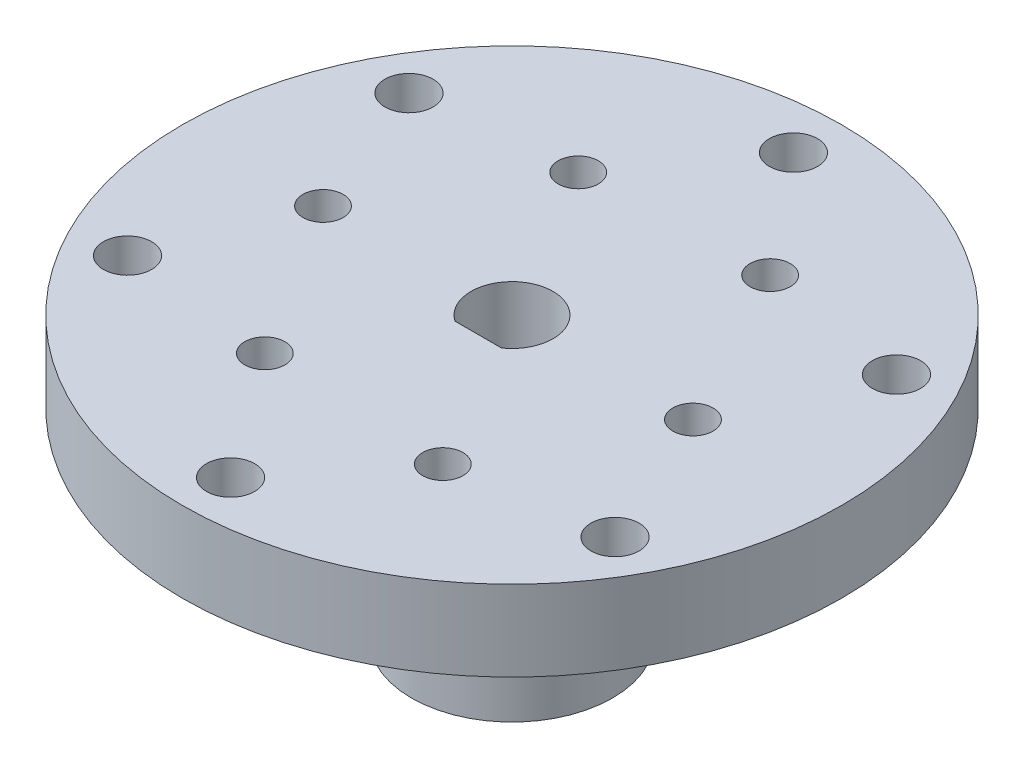
ISO-10303-21;
HEADER;
FILE_DESCRIPTION(('STEP AP214'),'2;1');
FILE_NAME('part.step','',(''),(''),'','','');
FILE_SCHEMA(('AUTOMOTIVE_DESIGN { 1 0 10303 214 1 1 1 1 }'));
ENDSEC;
DATA;
#1=APPLICATION_CONTEXT('core data for automotive mechanical design processes');
#2=APPLICATION_PROTOCOL_DEFINITION('international standard','automotive_design',2000,#1);
#3=PRODUCT_CONTEXT('',#1,'mechanical');
#4=PRODUCT('Part','Part','',(#3));
#5=PRODUCT_RELATED_PRODUCT_CATEGORY('part','',(#4));
#6=PRODUCT_DEFINITION_FORMATION('','',#4);
#7=PRODUCT_DEFINITION_CONTEXT('part definition',#1,'design');
#8=PRODUCT_DEFINITION('design','',#6,#7);
#9=PRODUCT_DEFINITION_SHAPE('','',#8);
#10=(LENGTH_UNIT() NAMED_UNIT(*) SI_UNIT(.MILLI.,.METRE.));
#11=(NAMED_UNIT(*) PLANE_ANGLE_UNIT() SI_UNIT($,.RADIAN.));
#12=(NAMED_UNIT(*) SI_UNIT($,.STERADIAN.) SOLID_ANGLE_UNIT());
#13=UNCERTAINTY_MEASURE_WITH_UNIT(LENGTH_MEASURE(1.E-05),#10,'distance_accuracy_value','');
#14=(GEOMETRIC_REPRESENTATION_CONTEXT(3) GLOBAL_UNCERTAINTY_ASSIGNED_CONTEXT((#13)) GLOBAL_UNIT_ASSIGNED_CONTEXT((#10,
#11,#12)) REPRESENTATION_CONTEXT('',''));
#15=CARTESIAN_POINT('',(0.,0.,0.));
#16=DIRECTION('',(0.,0.,1.));
#17=DIRECTION('',(1.,0.,0.));
#18=AXIS2_PLACEMENT_3D('',#15,#16,#17);
#19=CARTESIAN_POINT('',(0.,35.,0.));
#20=DIRECTION('',(0.,-1.,0.));
#21=DIRECTION('',(0.,0.,-1.));
#22=AXIS2_PLACEMENT_3D('',#19,#20,#21);
#23=CYLINDRICAL_SURFACE('',#22,41.);
#24=CARTESIAN_POINT('',(0.,35.,0.));
#25=DIRECTION('',(0.,1.,0.));
#26=DIRECTION('',(0.,0.,1.));
#27=AXIS2_PLACEMENT_3D('',#24,#25,#26);
#28=CIRCLE('',#27,41.);
#29=CARTESIAN_POINT('',(0.,35.,41.));
#30=VERTEX_POINT('',#29);
#31=EDGE_CURVE('E69',#30,#30,#28,.T.);
#32=ORIENTED_EDGE('',*,*,#31,.F.);
#33=EDGE_LOOP('',(#32));
#34=FACE_BOUND('',#33,.T.);
#35=CARTESIAN_POINT('',(0.,25.,0.));
#36=DIRECTION('',(0.,-1.,0.));
#37=DIRECTION('',(0.,0.,-1.));
#38=AXIS2_PLACEMENT_3D('',#35,#36,#37);
#39=CIRCLE('',#38,41.);
#40=CARTESIAN_POINT('',(0.,25.,-41.));
#41=VERTEX_POINT('',#40);
#42=EDGE_CURVE('E120',#41,#41,#39,.T.);
#43=ORIENTED_EDGE('',*,*,#42,.F.);
#44=EDGE_LOOP('',(#43));
#45=FACE_BOUND('',#44,.T.);
#46=ADVANCED_FACE('F36',(#34,#45),#23,.T.);
#47=CARTESIAN_POINT('',(30.3108891324554,0.,-17.5));
#48=DIRECTION('',(0.,1.,0.));
#49=DIRECTION('',(0.,0.,1.));
#50=AXIS2_PLACEMENT_3D('',#47,#48,#49);
#51=CYLINDRICAL_SURFACE('',#50,3.00000000000009);
#52=CARTESIAN_POINT('',(30.3108891324554,35.,-17.5));
#53=DIRECTION('',(0.,1.,0.));
#54=DIRECTION('',(0.,0.,1.));
#55=AXIS2_PLACEMENT_3D('',#52,#53,#54);
#56=CIRCLE('',#55,3.00000000000009);
#57=CARTESIAN_POINT('',(30.3108891324554,35.,-14.4999999999999));
#58=VERTEX_POINT('',#57);
#59=EDGE_CURVE('E94',#58,#58,#56,.T.);
#60=ORIENTED_EDGE('',*,*,#59,.T.);
#61=EDGE_LOOP('',(#60));
#62=FACE_BOUND('',#61,.T.);
#63=CARTESIAN_POINT('',(30.3108891324554,25.,-17.5));
#64=DIRECTION('',(0.,-1.,0.));
#65=DIRECTION('',(0.,0.,-1.));
#66=AXIS2_PLACEMENT_3D('',#63,#64,#65);
#67=CIRCLE('',#66,3.00000000000009);
#68=CARTESIAN_POINT('',(30.3108891324554,25.,-20.5000000000001));
#69=VERTEX_POINT('',#68);
#70=EDGE_CURVE('E115',#69,#69,#67,.F.);
#71=ORIENTED_EDGE('',*,*,#70,.F.);
#72=EDGE_LOOP('',(#71));
#73=FACE_BOUND('',#72,.T.);
#74=ADVANCED_FACE('F199',(#62,#73),#51,.F.);
#75=CARTESIAN_POINT('',(30.3108891324554,0.,17.5));
#76=DIRECTION('',(0.,1.,0.));
#77=DIRECTION('',(0.,0.,1.));
#78=AXIS2_PLACEMENT_3D('',#75,#76,#77);
#79=CYLINDRICAL_SURFACE('',#78,3.00000000000017);
#80=CARTESIAN_POINT('',(30.3108891324554,35.,17.5));
#81=DIRECTION('',(0.,1.,0.));
#82=DIRECTION('',(0.,0.,1.));
#83=AXIS2_PLACEMENT_3D('',#80,#81,#82);
#84=CIRCLE('',#83,3.00000000000017);
#85=CARTESIAN_POINT('',(30.3108891324554,35.,20.5000000000002));
#86=VERTEX_POINT('',#85);
#87=EDGE_CURVE('E100',#86,#86,#84,.T.);
#88=ORIENTED_EDGE('',*,*,#87,.T.);
#89=EDGE_LOOP('',(#88));
#90=FACE_BOUND('',#89,.T.);
#91=CARTESIAN_POINT('',(30.3108891324554,25.,17.5));
#92=DIRECTION('',(0.,-1.,0.));
#93=DIRECTION('',(0.,0.,-1.));
#94=AXIS2_PLACEMENT_3D('',#91,#92,#93);
#95=CIRCLE('',#94,3.00000000000017);
#96=CARTESIAN_POINT('',(30.3108891324554,25.,14.4999999999998));
#97=VERTEX_POINT('',#96);
#98=EDGE_CURVE('E159',#97,#97,#95,.F.);
#99=ORIENTED_EDGE('',*,*,#98,.F.);
#100=EDGE_LOOP('',(#99));
#101=FACE_BOUND('',#100,.T.);
#102=ADVANCED_FACE('F202',(#90,#101),#79,.F.);
#103=CARTESIAN_POINT('',(0.,0.,35.));
#104=DIRECTION('',(0.,1.,0.));
#105=DIRECTION('',(0.,0.,1.));
#106=AXIS2_PLACEMENT_3D('',#103,#104,#105);
#107=CYLINDRICAL_SURFACE('',#106,3.00000000000024);
#108=CARTESIAN_POINT('',(0.,35.,35.));
#109=DIRECTION('',(0.,1.,0.));
#110=DIRECTION('',(0.,0.,1.));
#111=AXIS2_PLACEMENT_3D('',#108,#109,#110);
#112=CIRCLE('',#111,3.00000000000024);
#113=CARTESIAN_POINT('',(0.,35.,38.0000000000002));
#114=VERTEX_POINT('',#113);
#115=EDGE_CURVE('E103',#114,#114,#112,.T.);
#116=ORIENTED_EDGE('',*,*,#115,.T.);
#117=EDGE_LOOP('',(#116));
#118=FACE_BOUND('',#117,.T.);
#119=CARTESIAN_POINT('',(0.,25.,35.));
#120=DIRECTION('',(0.,-1.,0.));
#121=DIRECTION('',(0.,0.,-1.));
#122=AXIS2_PLACEMENT_3D('',#119,#120,#121);
#123=CIRCLE('',#122,3.00000000000024);
#124=CARTESIAN_POINT('',(0.,25.,31.9999999999998));
#125=VERTEX_POINT('',#124);
#126=EDGE_CURVE('E156',#125,#125,#123,.F.);
#127=ORIENTED_EDGE('',*,*,#126,.F.);
#128=EDGE_LOOP('',(#127));
#129=FACE_BOUND('',#128,.T.);
#130=ADVANCED_FACE('F206',(#118,#129),#107,.F.);
#131=CARTESIAN_POINT('',(-30.3108891324554,0.,17.5));
#132=DIRECTION('',(0.,1.,0.));
#133=DIRECTION('',(0.,0.,1.));
#134=AXIS2_PLACEMENT_3D('',#131,#132,#133);
#135=CYLINDRICAL_SURFACE('',#134,3.00000000000033);
#136=CARTESIAN_POINT('',(-30.3108891324554,35.,17.5));
#137=DIRECTION('',(0.,1.,0.));
#138=DIRECTION('',(0.,0.,1.));
#139=AXIS2_PLACEMENT_3D('',#136,#137,#138);
#140=CIRCLE('',#139,3.00000000000033);
#141=CARTESIAN_POINT('',(-30.3108891324554,35.,20.5000000000003));
#142=VERTEX_POINT('',#141);
#143=EDGE_CURVE('E97',#142,#142,#140,.T.);
#144=ORIENTED_EDGE('',*,*,#143,.T.);
#145=EDGE_LOOP('',(#144));
#146=FACE_BOUND('',#145,.T.);
#147=CARTESIAN_POINT('',(-30.3108891324554,25.,17.5));
#148=DIRECTION('',(0.,-1.,0.));
#149=DIRECTION('',(0.,0.,-1.));
#150=AXIS2_PLACEMENT_3D('',#147,#148,#149);
#151=CIRCLE('',#150,3.00000000000033);
#152=CARTESIAN_POINT('',(-30.3108891324554,25.,14.4999999999997));
#153=VERTEX_POINT('',#152);
#154=EDGE_CURVE('E153',#153,#153,#151,.F.);
#155=ORIENTED_EDGE('',*,*,#154,.F.);
#156=EDGE_LOOP('',(#155));
#157=FACE_BOUND('',#156,.T.);
#158=ADVANCED_FACE('F197',(#146,#157),#135,.F.);
#159=CARTESIAN_POINT('',(-30.3108891324554,0.,-17.5));
#160=DIRECTION('',(0.,1.,0.));
#161=DIRECTION('',(0.,0.,1.));
#162=AXIS2_PLACEMENT_3D('',#159,#160,#161);
#163=CYLINDRICAL_SURFACE('',#162,3.00000000000042);
#164=CARTESIAN_POINT('',(-30.3108891324554,35.,-17.5));
#165=DIRECTION('',(0.,1.,0.));
#166=DIRECTION('',(0.,0.,1.));
#167=AXIS2_PLACEMENT_3D('',#164,#165,#166);
#168=CIRCLE('',#167,3.00000000000042);
#169=CARTESIAN_POINT('',(-30.3108891324554,35.,-14.4999999999996));
#170=VERTEX_POINT('',#169);
#171=EDGE_CURVE('E77',#170,#170,#168,.T.);
#172=ORIENTED_EDGE('',*,*,#171,.T.);
#173=EDGE_LOOP('',(#172));
#174=FACE_BOUND('',#173,.T.);
#175=CARTESIAN_POINT('',(-30.3108891324554,25.,-17.5));
#176=DIRECTION('',(0.,-1.,0.));
#177=DIRECTION('',(0.,0.,-1.));
#178=AXIS2_PLACEMENT_3D('',#175,#176,#177);
#179=CIRCLE('',#178,3.00000000000042);
#180=CARTESIAN_POINT('',(-30.3108891324554,25.,-20.5000000000004));
#181=VERTEX_POINT('',#180);
#182=EDGE_CURVE('E119',#181,#181,#179,.F.);
#183=ORIENTED_EDGE('',*,*,#182,.F.);
#184=EDGE_LOOP('',(#183));
#185=FACE_BOUND('',#184,.T.);
#186=ADVANCED_FACE('F193',(#174,#185),#163,.F.);
#187=CARTESIAN_POINT('',(0.,0.,-35.));
#188=DIRECTION('',(0.,1.,0.));
#189=DIRECTION('',(0.,0.,1.));
#190=AXIS2_PLACEMENT_3D('',#187,#188,#189);
#191=CYLINDRICAL_SURFACE('',#190,3.);
#192=CARTESIAN_POINT('',(0.,35.,-35.));
#193=DIRECTION('',(0.,1.,0.));
#194=DIRECTION('',(0.,0.,1.));
#195=AXIS2_PLACEMENT_3D('',#192,#193,#194);
#196=CIRCLE('',#195,3.);
#197=CARTESIAN_POINT('',(0.,35.,-32.));
#198=VERTEX_POINT('',#197);
#199=EDGE_CURVE('E70',#198,#198,#196,.T.);
#200=ORIENTED_EDGE('',*,*,#199,.T.);
#201=EDGE_LOOP('',(#200));
#202=FACE_BOUND('',#201,.T.);
#203=CARTESIAN_POINT('',(0.,25.,-35.));
#204=DIRECTION('',(0.,-1.,0.));
#205=DIRECTION('',(0.,0.,-1.));
#206=AXIS2_PLACEMENT_3D('',#203,#204,#205);
#207=CIRCLE('',#206,3.);
#208=CARTESIAN_POINT('',(0.,25.,-38.));
#209=VERTEX_POINT('',#208);
#210=EDGE_CURVE('E116',#209,#209,#207,.F.);
#211=ORIENTED_EDGE('',*,*,#210,.F.);
#212=EDGE_LOOP('',(#211));
#213=FACE_BOUND('',#212,.T.);
#214=ADVANCED_FACE('F189',(#202,#213),#191,.F.);
#215=CARTESIAN_POINT('',(0.,0.,0.));
#216=DIRECTION('',(0.,1.,0.));
#217=DIRECTION('',(0.,0.,1.));
#218=AXIS2_PLACEMENT_3D('',#215,#216,#217);
#219=PLANE('',#218);
#220=CARTESIAN_POINT('',(0.,0.,0.));
#221=DIRECTION('',(0.,1.,0.));
#222=DIRECTION('',(0.,0.,1.));
#223=AXIS2_PLACEMENT_3D('',#220,#221,#222);
#224=CIRCLE('',#223,12.5);
#225=CARTESIAN_POINT('',(0.,0.,12.5));
#226=VERTEX_POINT('',#225);
#227=EDGE_CURVE('E11',#226,#226,#224,.T.);
#228=ORIENTED_EDGE('',*,*,#227,.F.);
#229=EDGE_LOOP('',(#228));
#230=FACE_BOUND('',#229,.T.);
#231=CARTESIAN_POINT('',(0.,0.,0.));
#232=DIRECTION('',(0.,1.,0.));
#233=DIRECTION('',(0.,0.,1.));
#234=AXIS2_PLACEMENT_3D('',#231,#232,#233);
#235=CIRCLE('',#234,5.1);
#236=CARTESIAN_POINT('',(2.89309522829788,0.,4.2));
#237=VERTEX_POINT('',#236);
#238=CARTESIAN_POINT('',(-2.89309522829788,0.,4.2));
#239=VERTEX_POINT('',#238);
#240=EDGE_CURVE('E46',#237,#239,#235,.T.);
#241=ORIENTED_EDGE('',*,*,#240,.T.);
#242=DIRECTION('',(1.,0.,0.));
#243=VECTOR('',#242,1.);
#244=CARTESIAN_POINT('',(0.,0.,4.2));
#245=LINE('',#244,#243);
#246=EDGE_CURVE('E80',#239,#237,#245,.T.);
#247=ORIENTED_EDGE('',*,*,#246,.T.);
#248=EDGE_LOOP('',(#241,#247));
#249=FACE_BOUND('',#248,.T.);
#250=ADVANCED_FACE('F192',(#230,#249),#219,.F.);
#251=CARTESIAN_POINT('',(0.,15.,0.));
#252=DIRECTION('',(0.,-1.,0.));
#253=DIRECTION('',(0.,0.,-1.));
#254=AXIS2_PLACEMENT_3D('',#251,#252,#253);
#255=CYLINDRICAL_SURFACE('',#254,12.5);
#256=CARTESIAN_POINT('',(0.,10.5,-12.5));
#257=CARTESIAN_POINT('',(-0.0839320235538497,10.4999964180293,-12.499998867873));
#258=CARTESIAN_POINT('',(-0.167917158665596,10.4929316706537,-12.4991457100204));
#259=CARTESIAN_POINT('',(-0.333552285654125,10.4648594679223,-12.495824352711));
#260=CARTESIAN_POINT('',(-0.415199714795035,10.4438372793747,-12.4933544466864));
#261=CARTESIAN_POINT('',(-0.573737397670265,10.388476861737,-12.4870779632713));
#262=CARTESIAN_POINT('',(-0.650630743796124,10.3541473965879,-12.4832722657654));
#263=CARTESIAN_POINT('',(-0.797549578916001,10.2731656324583,-12.4747479632173));
#264=CARTESIAN_POINT('',(-0.867576283567579,10.2265155201233,-12.4700295202071));
#265=CARTESIAN_POINT('',(-0.999145657672256,10.1219625690124,-12.460180052721));
#266=CARTESIAN_POINT('',(-1.0606483456536,10.064009579944,-12.4550472515452));
#267=CARTESIAN_POINT('',(-1.17307965519171,9.93860351755605,-12.4449619698576));
#268=CARTESIAN_POINT('',(-1.22400774913237,9.87114997049068,-12.4400094983534));
#269=CARTESIAN_POINT('',(-1.31399171436948,9.72839958735081,-12.4308280185202));
#270=CARTESIAN_POINT('',(-1.35301037836285,9.65307913770993,-12.4266012951985));
#271=CARTESIAN_POINT('',(-1.4178302865078,9.49689564894563,-12.4193730672343));
#272=CARTESIAN_POINT('',(-1.44363199348388,9.41603280401535,-12.4163715196899));
#273=CARTESIAN_POINT('',(-1.481164650227,9.25147357034429,-12.4119503036869));
#274=CARTESIAN_POINT('',(-1.49296288993823,9.16779273578616,-12.4105230726271));
#275=CARTESIAN_POINT('',(-1.50236187609835,8.99962753181792,-12.4093888845306));
#276=CARTESIAN_POINT('',(-1.49996315026424,8.91514319239151,-12.4096818635516));
#277=CARTESIAN_POINT('',(-1.48109158039334,8.74823701760782,-12.4119480733153));
#278=CARTESIAN_POINT('',(-1.46469271611151,8.66580668065991,-12.4139124717338));
#279=CARTESIAN_POINT('',(-1.41840173085034,8.50487648608932,-12.4192864043804));
#280=CARTESIAN_POINT('',(-1.38850935612907,8.4263767024105,-12.4226959657844));
#281=CARTESIAN_POINT('',(-1.31599990349931,8.27530526588044,-12.4305861039738));
#282=CARTESIAN_POINT('',(-1.27335053101963,8.20274926082322,-12.4350693931099));
#283=CARTESIAN_POINT('',(-1.17656086584735,8.06579639454212,-12.444599699395));
#284=CARTESIAN_POINT('',(-1.12242008861578,8.00139987754871,-12.4496467403106));
#285=CARTESIAN_POINT('',(-1.0037737778109,7.88216445781781,-12.4597751654319));
#286=CARTESIAN_POINT('',(-0.93920445025608,7.82738901507147,-12.464856563712));
#287=CARTESIAN_POINT('',(-0.801753979469361,7.72944423949984,-12.4744510399275));
#288=CARTESIAN_POINT('',(-0.728872819540024,7.68627492999042,-12.478964116721));
#289=CARTESIAN_POINT('',(-0.576819654131424,7.61276835718017,-12.4869159430851));
#290=CARTESIAN_POINT('',(-0.497645789357797,7.58243490333478,-12.4903543736405));
#291=CARTESIAN_POINT('',(-0.335278011136722,7.53551063107455,-12.4957665326545));
#292=CARTESIAN_POINT('',(-0.252084271220813,7.51891921999776,-12.4977403242792));
#293=CARTESIAN_POINT('',(-0.08458719818711,7.50003187225115,-12.4999926250152));
#294=CARTESIAN_POINT('',(-0.000293860216027525,7.49764848379965,-12.5002815046876));
#295=CARTESIAN_POINT('',(0.167491034121628,7.50701428893413,-12.4991593911616));
#296=CARTESIAN_POINT('',(0.250982606163663,7.51876320564768,-12.4977484312654));
#297=CARTESIAN_POINT('',(0.414537131964177,7.55598748200154,-12.4933916690343));
#298=CARTESIAN_POINT('',(0.494609673184516,7.58142130652504,-12.4904505118954));
#299=CARTESIAN_POINT('',(0.649352698843229,7.64525035167679,-12.4833627750896));
#300=CARTESIAN_POINT('',(0.724023012961736,7.68364598074504,-12.4792161574379));
#301=CARTESIAN_POINT('',(0.866233588832521,7.77252145795121,-12.4701542579347));
#302=CARTESIAN_POINT('',(0.933738144813754,7.8230580689054,-12.4652354042322));
#303=CARTESIAN_POINT('',(1.05933812576102,7.93470042320408,-12.455190895971));
#304=CARTESIAN_POINT('',(1.11743320736474,7.99580655207397,-12.4500652338742));
#305=CARTESIAN_POINT('',(1.22287397613077,8.12723780771384,-12.4401529742471));
#306=CARTESIAN_POINT('',(1.27016181615969,8.19760950767192,-12.4353682915654));
#307=CARTESIAN_POINT('',(1.35224657214666,8.34534751253778,-12.4267107496692));
#308=CARTESIAN_POINT('',(1.38704372178037,8.42271368655912,-12.4228378733971));
#309=CARTESIAN_POINT('',(1.44306498334079,8.58205530444734,-12.4164552867251));
#310=CARTESIAN_POINT('',(1.46432210079673,8.66401900592969,-12.4139422637816));
#311=CARTESIAN_POINT('',(1.49276636081758,8.83038448474253,-12.4105542637293));
#312=CARTESIAN_POINT('',(1.49995410263041,8.91478615807866,-12.4096792168553));
#313=CARTESIAN_POINT('',(1.50004516908965,9.08305636481858,-12.4096681633035));
#314=CARTESIAN_POINT('',(1.49303936835675,9.16692486288563,-12.4105210931972));
#315=CARTESIAN_POINT('',(1.46513424336044,9.33228339319708,-12.4138461473713));
#316=CARTESIAN_POINT('',(1.44423491411034,9.41377342458779,-12.4163182722328));
#317=CARTESIAN_POINT('',(1.38916369910273,9.57205226944434,-12.4225998262293));
#318=CARTESIAN_POINT('',(1.35499582785269,9.64884249674774,-12.4264088508406));
#319=CARTESIAN_POINT('',(1.27436641314005,9.79561387353505,-12.4349357269569));
#320=CARTESIAN_POINT('',(1.22790476354723,9.86559496422965,-12.4396535863076));
#321=CARTESIAN_POINT('',(1.12366844823603,9.99722647005441,-12.4495027561294));
#322=CARTESIAN_POINT('',(1.06582601965075,10.0588230516331,-12.4546364290673));
#323=CARTESIAN_POINT('',(0.940610466672237,10.171471239783,-12.4647177484085));
#324=CARTESIAN_POINT('',(0.873235091318004,10.2225203488146,-12.4696653505255));
#325=CARTESIAN_POINT('',(0.730596612325683,10.3127752889994,-12.4788360854662));
#326=CARTESIAN_POINT('',(0.655306617312087,10.3519388628611,-12.4830566108105));
#327=CARTESIAN_POINT('',(0.499211375842655,10.4170118822213,-12.4902709259863));
#328=CARTESIAN_POINT('',(0.418412282181072,10.4429358480902,-12.4932660590307));
#329=CARTESIAN_POINT('',(0.280988550618348,10.4745317101691,-12.4969634163));
#330=CARTESIAN_POINT('',(0.225233284876744,10.4840687419432,-12.4980966397165));
#331=CARTESIAN_POINT('',(0.112993367846847,10.4968040717455,-12.4996153102102));
#332=CARTESIAN_POINT('',(0.0565087213768127,10.5000024116252,-12.5000007622246));
#333=CARTESIAN_POINT('',(0.,10.5,-12.5));
#334=B_SPLINE_CURVE_WITH_KNOTS('',3,(#256,#257,#258,#259,#260,#261,#262,#263,#264,#265,#266,
#267,#268,#269,#270,#271,#272,#273,#274,#275,#276,#277,#278,#279,#280,#281,#282,#283,#284,#285,
#286,#287,#288,#289,#290,#291,#292,#293,#294,#295,#296,#297,#298,#299,#300,#301,#302,#303,#304,
#305,#306,#307,#308,#309,#310,#311,#312,#313,#314,#315,#316,#317,#318,#319,#320,#321,#322,#323,
#324,#325,#326,#327,#328,#329,#330,#331,#332,#333),.UNSPECIFIED.,.T.,.F.,(4,2,2,2,2,2,2,2,2,2,2,
2,2,2,2,2,2,2,2,2,2,2,2,2,2,2,2,2,2,2,2,2,2,2,2,2,2,2,4),(0.,0.25158967547808,0.503445347043117,
0.7551354318778,1.00678087720847,1.25956936097939,1.51237045452442,1.76595344748199,
2.01952755999557,2.27187819171639,2.5242194433424,2.77523546456126,3.02625620626698,
3.27791786855268,3.52959014434631,3.78286472320158,4.036139810863,4.28949001347139,
4.5428292891131,4.79460761312113,5.04638100450539,5.29739451278874,5.54841593150834,
5.80063460892782,6.05286248801783,6.30641037908359,6.55995352653149,6.81287624132444,
7.06578818330771,7.31708596596146,7.56838383881169,7.81960573856942,8.07082980715608,
8.3235976201016,8.57642521760046,8.8301414511973,9.08357882396374,9.25296714728134,
9.42235435219904),.UNSPECIFIED.);
#335=CARTESIAN_POINT('',(0.,10.5,-12.5));
#336=VERTEX_POINT('',#335);
#337=EDGE_CURVE('E83',#336,#336,#334,.T.);
#338=ORIENTED_EDGE('',*,*,#337,.T.);
#339=EDGE_LOOP('',(#338));
#340=FACE_BOUND('',#339,.T.);
#341=CARTESIAN_POINT('',(-1.5,9.,12.4096736459909));
#342=CARTESIAN_POINT('',(-1.49999641586388,9.08392957059518,12.4096748089167));
#343=CARTESIAN_POINT('',(-1.49293206748169,9.1679122600607,12.4105342894214));
#344=CARTESIAN_POINT('',(-1.46486159354819,9.33354230601578,12.4138782255216));
#345=CARTESIAN_POINT('',(-1.44384072619508,9.41518709784051,12.4163643992983));
#346=CARTESIAN_POINT('',(-1.38848417307918,9.5737192027569,12.4226761552619));
#347=CARTESIAN_POINT('',(-1.35415731394874,9.65060963056811,12.426500849368));
#348=CARTESIAN_POINT('',(-1.27318168778971,9.79752357105048,12.4350576249844));
#349=CARTESIAN_POINT('',(-1.22653510106008,9.86754829578398,12.4397895458966));
#350=CARTESIAN_POINT('',(-1.1219857196502,9.99911988580508,12.4496550027324));
#351=CARTESIAN_POINT('',(-1.06403198625323,10.0606261471743,12.4547902908254));
#352=CARTESIAN_POINT('',(-0.938622932174397,10.1730643590809,12.4648680792729));
#353=CARTESIAN_POINT('',(-0.871167147527071,10.2239957929709,12.4698105701984));
#354=CARTESIAN_POINT('',(-0.728414784233991,10.3139832664681,12.4789637011531));
#355=CARTESIAN_POINT('',(-0.653094976924497,10.3530027078698,12.4831720690333));
#356=CARTESIAN_POINT('',(-0.496912883636391,10.4178242301924,12.4903635621621));
#357=CARTESIAN_POINT('',(-0.416050788042773,10.4436267648739,12.4933467294733));
#358=CARTESIAN_POINT('',(-0.251493928492543,10.4811611280517,12.4977393662263));
#359=CARTESIAN_POINT('',(-0.167814735521691,10.4929603267229,12.4991563682204));
#360=CARTESIAN_POINT('',(0.000347248334280875,10.5023617996553,12.5002827183051));
#361=CARTESIAN_POINT('',(0.0848300098341681,10.4999645910791,12.4999921286017));
#362=CARTESIAN_POINT('',(0.251742833758763,10.4810954390743,12.4977421462633));
#363=CARTESIAN_POINT('',(0.334181218784105,10.4646959475138,12.4957913442169));
#364=CARTESIAN_POINT('',(0.495127185045587,10.418400924142,12.490449821119));
#365=CARTESIAN_POINT('',(0.5736346965213,10.3885051529092,12.4870590745233));
#366=CARTESIAN_POINT('',(0.724715561629686,10.3159886355467,12.4792038952277));
#367=CARTESIAN_POINT('',(0.79727364863769,10.2733363819968,12.4747368094346));
#368=CARTESIAN_POINT('',(0.93422946009939,10.1765405505219,12.465229048358));
#369=CARTESIAN_POINT('',(0.998626839383444,10.1223964867922,12.4601883488298));
#370=CARTESIAN_POINT('',(1.11785860561525,10.0037478252298,12.4500603372648));
#371=CARTESIAN_POINT('',(1.17263019439189,9.93918010931325,12.4449729316271));
#372=CARTESIAN_POINT('',(1.27056795912578,9.80173424316025,12.4353563023037));
#373=CARTESIAN_POINT('',(1.31373410365263,9.72885607041776,12.4308270801297));
#374=CARTESIAN_POINT('',(1.38723839179325,9.57680375492631,12.4228396027608));
#375=CARTESIAN_POINT('',(1.41757175578821,9.49762727937105,12.4193817467283));
#376=CARTESIAN_POINT('',(1.46449505016189,9.33525382024941,12.4139364153306));
#377=CARTESIAN_POINT('',(1.48108558929275,9.25205701494035,12.4119488748366));
#378=CARTESIAN_POINT('',(1.49996964356083,9.08455845181166,12.4096810007818));
#379=CARTESIAN_POINT('',(1.50235142135386,9.00026678205943,12.4093901280317));
#380=CARTESIAN_POINT('',(1.49298299027801,8.83248560957853,12.4105206650573));
#381=CARTESIAN_POINT('',(1.48123305845624,8.74899609115631,12.411942041265));
#382=CARTESIAN_POINT('',(1.44400895971009,8.58545210820101,12.4163273137489));
#383=CARTESIAN_POINT('',(1.41857731249469,8.50538782659534,12.4192864301079));
#384=CARTESIAN_POINT('',(1.35475538396312,8.35066035851202,12.4264098926624));
#385=CARTESIAN_POINT('',(1.31636468129306,8.27599734774847,12.4305742780457));
#386=CARTESIAN_POINT('',(1.22749651360805,8.13379185251269,12.4396643656649));
#387=CARTESIAN_POINT('',(1.17696103570738,8.06628585655934,12.4445936804928));
#388=CARTESIAN_POINT('',(1.06532008918354,7.9406824434941,12.4546467770184));
#389=CARTESIAN_POINT('',(1.0042142422181,7.88258536329706,12.4597705656719));
#390=CARTESIAN_POINT('',(0.872782136333862,7.77714012638254,12.4696675472455));
#391=CARTESIAN_POINT('',(0.802409249708918,7.72984987674429,12.4744387628015));
#392=CARTESIAN_POINT('',(0.65466821470529,7.64776089533545,12.483063621558));
#393=CARTESIAN_POINT('',(0.577300197822209,7.61296192881278,12.4869172820019));
#394=CARTESIAN_POINT('',(0.417959622359993,7.5569394975621,12.4932640215257));
#395=CARTESIAN_POINT('',(0.335999085323591,7.53568224005787,12.4957604851314));
#396=CARTESIAN_POINT('',(0.169640292495739,7.50723662820892,12.4991255682254));
#397=CARTESIAN_POINT('',(0.0852421377306311,7.50004769165343,12.4999942550783));
#398=CARTESIAN_POINT('',(-0.0830300031278289,7.49995307794384,12.5000056524324));
#399=CARTESIAN_POINT('',(-0.166903952329435,7.50695798165839,12.4991591682624));
#400=CARTESIAN_POINT('',(-0.332273612398117,7.53486322745123,12.4958567701035));
#401=CARTESIAN_POINT('',(-0.413769324044743,7.55576356497476,12.4934008566421));
#402=CARTESIAN_POINT('',(-0.572059777991807,7.61083900756579,12.4871544009745));
#403=CARTESIAN_POINT('',(-0.648855904373998,7.64501018222724,12.4833642539575));
#404=CARTESIAN_POINT('',(-0.795637705262655,7.7256480347922,12.474869622158));
#405=CARTESIAN_POINT('',(-0.86562332464685,7.77211481220143,12.4701651299761));
#406=CARTESIAN_POINT('',(-0.997254742124291,7.87635684100312,12.4603319681132));
#407=CARTESIAN_POINT('',(-1.0588476339384,7.93419867766288,12.4552009088046));
#408=CARTESIAN_POINT('',(-1.17148865356204,8.05941151857621,12.4451123432295));
#409=CARTESIAN_POINT('',(-1.22253427406543,8.12678478225065,12.4401548784622));
#410=CARTESIAN_POINT('',(-1.31278537364373,8.26942146808524,12.4309559603764));
#411=CARTESIAN_POINT('',(-1.35194799100155,8.34471216413647,12.4267171228205));
#412=CARTESIAN_POINT('',(-1.41701902911872,8.50080887687538,12.419466118837));
#413=CARTESIAN_POINT('',(-1.44294198213015,8.58160873559888,12.4164526081981));
#414=CARTESIAN_POINT('',(-1.4745350503682,8.71902976955269,12.4127313618494));
#415=CARTESIAN_POINT('',(-1.48407082470974,8.77478137597994,12.4115903654975));
#416=CARTESIAN_POINT('',(-1.49680448454756,8.88701396606712,12.4100611186528));
#417=CARTESIAN_POINT('',(-1.50000241299709,8.94349494478129,12.4096728630583));
#418=CARTESIAN_POINT('',(-1.5,9.,12.4096736459909));
#419=B_SPLINE_CURVE_WITH_KNOTS('',3,(#341,#342,#343,#344,#345,#346,#347,#348,#349,#350,#351,
#352,#353,#354,#355,#356,#357,#358,#359,#360,#361,#362,#363,#364,#365,#366,#367,#368,#369,#370,
#371,#372,#373,#374,#375,#376,#377,#378,#379,#380,#381,#382,#383,#384,#385,#386,#387,#388,#389,
#390,#391,#392,#393,#394,#395,#396,#397,#398,#399,#400,#401,#402,#403,#404,#405,#406,#407,#408,
#409,#410,#411,#412,#413,#414,#415,#416,#417,#418),.UNSPECIFIED.,.T.,.F.,(4,2,2,2,2,2,2,2,2,2,2,
2,2,2,2,2,2,2,2,2,2,2,2,2,2,2,2,2,2,2,2,2,2,2,2,2,2,2,4),(0.,0.25158230660961,0.503430774819311,
0.755112462522261,1.0067496383611,1.25954776660377,1.5123582427361,1.76593780876769,
2.01950866836447,2.27185458608052,2.52419131111312,2.77523023079344,3.02627360403335,
3.27794222677635,3.52962149067918,3.78288622204422,4.03615163930559,4.28951130338294,
4.54285974404081,4.79463277043148,5.0464008609825,5.29739099483104,5.54838929022027,
5.80061125155308,6.05284224246467,6.30639464647639,6.55994228515918,6.81285470170487,
7.06575665136928,7.31707030939076,7.56838388503437,7.81962308616498,8.07086432058376,
8.32362252061905,8.57644073759112,8.83016031080822,9.08360079205963,9.25297814464872,
9.42235434931908),.UNSPECIFIED.);
#420=CARTESIAN_POINT('',(-1.5,9.,12.4096736459909));
#421=VERTEX_POINT('',#420);
#422=EDGE_CURVE('E169',#421,#421,#419,.T.);
#423=ORIENTED_EDGE('',*,*,#422,.T.);
#424=EDGE_LOOP('',(#423));
#425=FACE_BOUND('',#424,.T.);
#426=ORIENTED_EDGE('',*,*,#227,.T.);
#427=EDGE_LOOP('',(#426));
#428=FACE_BOUND('',#427,.T.);
#429=CARTESIAN_POINT('',(0.,25.,0.));
#430=DIRECTION('',(0.,-1.,0.));
#431=DIRECTION('',(0.,0.,-1.));
#432=AXIS2_PLACEMENT_3D('',#429,#430,#431);
#433=CIRCLE('',#432,12.5);
#434=CARTESIAN_POINT('',(0.,25.,-12.5));
#435=VERTEX_POINT('',#434);
#436=EDGE_CURVE('E138',#435,#435,#433,.T.);
#437=ORIENTED_EDGE('',*,*,#436,.T.);
#438=EDGE_LOOP('',(#437));
#439=FACE_BOUND('',#438,.T.);
#440=ADVANCED_FACE('F38',(#340,#425,#428,#439),#255,.T.);
#441=CARTESIAN_POINT('',(0.,15.,0.));
#442=DIRECTION('',(0.,-1.,0.));
#443=DIRECTION('',(0.,0.,-1.));
#444=AXIS2_PLACEMENT_3D('',#441,#442,#443);
#445=CYLINDRICAL_SURFACE('',#444,5.1);
#446=CARTESIAN_POINT('',(-1.5,9.,-4.87442304278157));
#447=CARTESIAN_POINT('',(-1.499998777418,8.91772431170111,-4.87442402861536));
#448=CARTESIAN_POINT('',(-1.49320767807488,8.8354364536677,-4.87652894094014));
#449=CARTESIAN_POINT('',(-1.46628922501432,8.67326110984117,-4.88468912220616));
#450=CARTESIAN_POINT('',(-1.44615701525299,8.59337450915642,-4.89074582955278));
#451=CARTESIAN_POINT('',(-1.39329471971112,8.43837249825743,-4.90606558372542));
#452=CARTESIAN_POINT('',(-1.3605849809776,8.36324960912243,-4.91532344951643));
#453=CARTESIAN_POINT('',(-1.28356247833666,8.2195403802262,-4.93599545776126));
#454=CARTESIAN_POINT('',(-1.23924812536949,8.15095493741571,-4.94740989546222));
#455=CARTESIAN_POINT('',(-1.13883145495901,8.02018134493171,-4.97149826594727));
#456=CARTESIAN_POINT('',(-1.08243805694275,7.9582214502336,-4.98419823132321));
#457=CARTESIAN_POINT('',(-0.960088306713088,7.84448793311208,-5.00920389472382));
#458=CARTESIAN_POINT('',(-0.894130773541884,7.79271557048563,-5.02150954382974));
#459=CARTESIAN_POINT('',(-0.752908827180202,7.6998428659353,-5.04463481218361));
#460=CARTESIAN_POINT('',(-0.677485964630889,7.65897418600943,-5.05542017455871));
#461=CARTESIAN_POINT('',(-0.520467382218736,7.59058807056586,-5.07398789229112));
#462=CARTESIAN_POINT('',(-0.438872943453937,7.56306787290954,-5.08177086884971));
#463=CARTESIAN_POINT('',(-0.27421440350307,7.52291221492369,-5.09327271102813));
#464=CARTESIAN_POINT('',(-0.191252804333004,7.50988738329158,-5.09709768582791));
#465=CARTESIAN_POINT('',(-0.0242396365989766,7.49786212433018,-5.10062573708328));
#466=CARTESIAN_POINT('',(0.0598117081933105,7.49885886194869,-5.10032964678629));
#467=CARTESIAN_POINT('',(0.22389080546119,7.51458471515103,-5.09572444157055));
#468=CARTESIAN_POINT('',(0.303962951240198,7.52889236338235,-5.09153849693209));
#469=CARTESIAN_POINT('',(0.460514905657466,7.5701468291415,-5.07977280532986));
#470=CARTESIAN_POINT('',(0.536994489995903,7.59709443468808,-5.07219284677284));
#471=CARTESIAN_POINT('',(0.685205766774365,7.66315605036428,-5.05431826841698));
#472=CARTESIAN_POINT('',(0.756873667943954,7.70240476754378,-5.0439937939185));
#473=CARTESIAN_POINT('',(0.892742524832507,7.79184855371005,-5.02172855574808));
#474=CARTESIAN_POINT('',(0.956941759379086,7.84204613825774,-5.0097874208793));
#475=CARTESIAN_POINT('',(1.07856664970008,7.95415838380621,-4.98504679339642));
#476=CARTESIAN_POINT('',(1.13565251960115,8.01643874013692,-4.97223189190049));
#477=CARTESIAN_POINT('',(1.23866336015887,8.14981533875092,-4.9475777889955));
#478=CARTESIAN_POINT('',(1.28458730935953,8.22091238697387,-4.93573867694891));
#479=CARTESIAN_POINT('',(1.36430680401454,8.37076929174911,-4.91430499035446));
#480=CARTESIAN_POINT('',(1.39799075044691,8.44959172488583,-4.90473133349264));
#481=CARTESIAN_POINT('',(1.45150845244901,8.61213630176944,-4.88916239231302));
#482=CARTESIAN_POINT('',(1.47134652076115,8.69585691100825,-4.88316599382807));
#483=CARTESIAN_POINT('',(1.49598342607639,8.86259759529384,-4.87567374883211));
#484=CARTESIAN_POINT('',(1.50129700673603,8.94553476238187,-4.87402394032498));
#485=CARTESIAN_POINT('',(1.49816804446781,9.11111686702487,-4.87498674827542));
#486=CARTESIAN_POINT('',(1.48972733850201,9.19376184212643,-4.87759879553833));
#487=CARTESIAN_POINT('',(1.45978702958488,9.35429744683874,-4.88664031889192));
#488=CARTESIAN_POINT('',(1.43861479743698,9.43225507123447,-4.89297400858584));
#489=CARTESIAN_POINT('',(1.38418988496673,9.58350756135393,-4.90864696611125));
#490=CARTESIAN_POINT('',(1.35093538943559,9.65680172450563,-4.91798668553701));
#491=CARTESIAN_POINT('',(1.27230109410694,9.79875133579148,-4.93892110117051));
#492=CARTESIAN_POINT('',(1.22662877739686,9.8672368425276,-4.95056806870916));
#493=CARTESIAN_POINT('',(1.12480543683789,9.99575997374761,-4.97469047373785));
#494=CARTESIAN_POINT('',(1.06865200355693,10.0557956501804,-4.98716610129724));
#495=CARTESIAN_POINT('',(0.945047498268353,10.1679450942473,-5.01208480833705));
#496=CARTESIAN_POINT('',(0.877261959477466,10.2196949772375,-5.02451047999962));
#497=CARTESIAN_POINT('',(0.733675294211845,10.3110916919382,-5.04747448655456));
#498=CARTESIAN_POINT('',(0.657874576414319,10.3507391403261,-5.05801291759964));
#499=CARTESIAN_POINT('',(0.500921820478804,10.4164239147366,-5.07594935690283));
#500=CARTESIAN_POINT('',(0.419815499600229,10.4425637236357,-5.08337092975581));
#501=CARTESIAN_POINT('',(0.254105021402068,10.4807616318213,-5.09434154101464));
#502=CARTESIAN_POINT('',(0.169501829070193,10.4928235894852,-5.0978916404744));
#503=CARTESIAN_POINT('',(0.00256837959271445,10.5022392899439,-5.10065734796156));
#504=CARTESIAN_POINT('',(-0.0797298527986582,10.5001217669911,-5.10002877951798));
#505=CARTESIAN_POINT('',(-0.242747927416505,10.4824958889187,-5.09487230295844));
#506=CARTESIAN_POINT('',(-0.323467852999185,10.4669882429449,-5.09034460134207));
#507=CARTESIAN_POINT('',(-0.480258037242961,10.4233448360585,-5.07794066114853));
#508=CARTESIAN_POINT('',(-0.55636662898358,10.3953365169408,-5.07009825701488));
#509=CARTESIAN_POINT('',(-0.70284508977583,10.3276004724592,-5.05187713568781));
#510=CARTESIAN_POINT('',(-0.773214035012332,10.2878708652478,-5.04149801127103));
#511=CARTESIAN_POINT('',(-0.908591173098056,10.1963870716203,-5.01889641037461));
#512=CARTESIAN_POINT('',(-0.973364842514521,10.1442976003806,-5.00662667612716));
#513=CARTESIAN_POINT('',(-1.0934290695309,10.0301823205387,-4.98178475560514));
#514=CARTESIAN_POINT('',(-1.14871693381334,9.9681536995363,-4.96921248458246));
#515=CARTESIAN_POINT('',(-1.24980864766202,9.83381202433037,-4.94477145121853));
#516=CARTESIAN_POINT('',(-1.29529964725674,9.76125750595862,-4.93293268657335));
#517=CARTESIAN_POINT('',(-1.37338254825658,9.60919327639633,-4.91176819006857));
#518=CARTESIAN_POINT('',(-1.40598108049732,9.52968716629974,-4.90244116716321));
#519=CARTESIAN_POINT('',(-1.45416592182648,9.37566416631895,-4.88834885091794));
#520=CARTESIAN_POINT('',(-1.47130770462975,9.30166845467846,-4.88317465327399));
#521=CARTESIAN_POINT('',(-1.49422427464231,9.15178504977911,-4.8762116021424));
#522=CARTESIAN_POINT('',(-1.50000112780784,9.07589770292864,-4.87442213336931));
#523=CARTESIAN_POINT('',(-1.5,9.,-4.87442304278157));
#524=B_SPLINE_CURVE_WITH_KNOTS('',3,(#446,#447,#448,#449,#450,#451,#452,#453,#454,#455,#456,
#457,#458,#459,#460,#461,#462,#463,#464,#465,#466,#467,#468,#469,#470,#471,#472,#473,#474,#475,
#476,#477,#478,#479,#480,#481,#482,#483,#484,#485,#486,#487,#488,#489,#490,#491,#492,#493,#494,
#495,#496,#497,#498,#499,#500,#501,#502,#503,#504,#505,#506,#507,#508,#509,#510,#511,#512,#513,
#514,#515,#516,#517,#518,#519,#520,#521,#522,#523),.UNSPECIFIED.,.T.,.F.,(4,2,2,2,2,2,2,2,2,2,2,
2,2,2,2,2,2,2,2,2,2,2,2,2,2,2,2,2,2,2,2,2,2,2,2,2,2,2,4),(0.,0.246547259926856,
0.493184310161924,0.739424035525714,0.985697496989513,1.23875465550579,1.49184308759857,
1.7499438473421,2.00799117670126,2.25892573703499,2.50980956108274,2.75301046004924,
2.99622652301843,3.24220497887892,3.4882400092496,3.74340553296065,3.99859439873895,
4.25605481191903,4.51343499497089,4.76156761532847,5.00966709890006,5.25164466605521,
5.49365860235296,5.74195882651312,5.99031620116843,6.24763248066831,6.50493564647013,
6.76025687262561,7.01550810534688,7.26129576893915,7.50707041632281,7.75039472818026,
7.99375812692556,8.24468369038357,8.49568038199449,8.75378371952302,9.0117541365357,
9.23923048600489,9.46666548021391),.UNSPECIFIED.);
#525=CARTESIAN_POINT('',(-1.5,9.,-4.87442304278157));
#526=VERTEX_POINT('',#525);
#527=EDGE_CURVE('E114',#526,#526,#524,.T.);
#528=ORIENTED_EDGE('',*,*,#527,.F.);
#529=EDGE_LOOP('',(#528));
#530=FACE_BOUND('',#529,.T.);
#531=DIRECTION('',(0.,-1.,0.));
#532=VECTOR('',#531,1.);
#533=CARTESIAN_POINT('',(2.89309522829788,35.,4.2));
#534=LINE('',#533,#532);
#535=CARTESIAN_POINT('',(2.89309522829788,35.,4.2));
#536=VERTEX_POINT('',#535);
#537=EDGE_CURVE('E72',#536,#237,#534,.T.);
#538=ORIENTED_EDGE('',*,*,#537,.F.);
#539=CARTESIAN_POINT('',(0.,35.,0.));
#540=DIRECTION('',(0.,1.,0.));
#541=DIRECTION('',(0.,0.,1.));
#542=AXIS2_PLACEMENT_3D('',#539,#540,#541);
#543=CIRCLE('',#542,5.1);
#544=CARTESIAN_POINT('',(-2.89309522829788,35.,4.2));
#545=VERTEX_POINT('',#544);
#546=EDGE_CURVE('E65',#536,#545,#543,.T.);
#547=ORIENTED_EDGE('',*,*,#546,.T.);
#548=DIRECTION('',(0.,-1.,0.));
#549=VECTOR('',#548,1.);
#550=CARTESIAN_POINT('',(-2.89309522829788,35.,4.2));
#551=LINE('',#550,#549);
#552=EDGE_CURVE('E54',#545,#239,#551,.T.);
#553=ORIENTED_EDGE('',*,*,#552,.T.);
#554=ORIENTED_EDGE('',*,*,#240,.F.);
#555=EDGE_LOOP('',(#538,#547,#553,#554));
#556=FACE_BOUND('',#555,.T.);
#557=ADVANCED_FACE('F73',(#530,#556),#445,.F.);
#558=CARTESIAN_POINT('',(0.,35.,0.));
#559=DIRECTION('',(0.,1.,0.));
#560=DIRECTION('',(0.,0.,1.));
#561=AXIS2_PLACEMENT_3D('',#558,#559,#560);
#562=PLANE('',#561);
#563=CARTESIAN_POINT('',(22.5,35.,0.));
#564=DIRECTION('',(0.,-1.,0.));
#565=DIRECTION('',(0.,0.,-1.));
#566=AXIS2_PLACEMENT_3D('',#563,#564,#565);
#567=CIRCLE('',#566,2.5);
#568=CARTESIAN_POINT('',(22.5,35.,-2.5));
#569=VERTEX_POINT('',#568);
#570=EDGE_CURVE('E125',#569,#569,#567,.T.);
#571=ORIENTED_EDGE('',*,*,#570,.T.);
#572=EDGE_LOOP('',(#571));
#573=FACE_BOUND('',#572,.T.);
#574=CARTESIAN_POINT('',(11.75,35.,-20.3515969889343));
#575=DIRECTION('',(0.,-1.,0.));
#576=DIRECTION('',(0.,0.,-1.));
#577=AXIS2_PLACEMENT_3D('',#574,#575,#576);
#578=CIRCLE('',#577,2.5);
#579=CARTESIAN_POINT('',(11.75,35.,-22.8515969889343));
#580=VERTEX_POINT('',#579);
#581=EDGE_CURVE('E274',#580,#580,#578,.T.);
#582=ORIENTED_EDGE('',*,*,#581,.T.);
#583=EDGE_LOOP('',(#582));
#584=FACE_BOUND('',#583,.T.);
#585=CARTESIAN_POINT('',(11.75,35.,20.3515969889343));
#586=DIRECTION('',(0.,-1.,0.));
#587=DIRECTION('',(0.,0.,-1.));
#588=AXIS2_PLACEMENT_3D('',#585,#586,#587);
#589=CIRCLE('',#588,2.5);
#590=CARTESIAN_POINT('',(11.75,35.,17.8515969889343));
#591=VERTEX_POINT('',#590);
#592=EDGE_CURVE('E148',#591,#591,#589,.T.);
#593=ORIENTED_EDGE('',*,*,#592,.T.);
#594=EDGE_LOOP('',(#593));
#595=FACE_BOUND('',#594,.T.);
#596=CARTESIAN_POINT('',(-11.25,35.,19.4855715851499));
#597=DIRECTION('',(0.,-1.,0.));
#598=DIRECTION('',(0.,0.,-1.));
#599=AXIS2_PLACEMENT_3D('',#596,#597,#598);
#600=CIRCLE('',#599,2.5);
#601=CARTESIAN_POINT('',(-11.25,35.,16.9855715851499));
#602=VERTEX_POINT('',#601);
#603=EDGE_CURVE('E271',#602,#602,#600,.T.);
#604=ORIENTED_EDGE('',*,*,#603,.T.);
#605=EDGE_LOOP('',(#604));
#606=FACE_BOUND('',#605,.T.);
#607=CARTESIAN_POINT('',(-11.25,35.,-19.4855715851499));
#608=DIRECTION('',(0.,-1.,0.));
#609=DIRECTION('',(0.,0.,-1.));
#610=AXIS2_PLACEMENT_3D('',#607,#608,#609);
#611=CIRCLE('',#610,2.5);
#612=CARTESIAN_POINT('',(-11.25,35.,-21.9855715851499));
#613=VERTEX_POINT('',#612);
#614=EDGE_CURVE('E266',#613,#613,#611,.T.);
#615=ORIENTED_EDGE('',*,*,#614,.T.);
#616=EDGE_LOOP('',(#615));
#617=FACE_BOUND('',#616,.T.);
#618=CARTESIAN_POINT('',(-23.5,35.,0.));
#619=DIRECTION('',(0.,-1.,0.));
#620=DIRECTION('',(0.,0.,-1.));
#621=AXIS2_PLACEMENT_3D('',#618,#619,#620);
#622=CIRCLE('',#621,2.5);
#623=CARTESIAN_POINT('',(-23.5,35.,-2.5));
#624=VERTEX_POINT('',#623);
#625=EDGE_CURVE('E264',#624,#624,#622,.T.);
#626=ORIENTED_EDGE('',*,*,#625,.T.);
#627=EDGE_LOOP('',(#626));
#628=FACE_BOUND('',#627,.T.);
#629=ORIENTED_EDGE('',*,*,#199,.F.);
#630=EDGE_LOOP('',(#629));
#631=FACE_BOUND('',#630,.T.);
#632=ORIENTED_EDGE('',*,*,#171,.F.);
#633=EDGE_LOOP('',(#632));
#634=FACE_BOUND('',#633,.T.);
#635=ORIENTED_EDGE('',*,*,#143,.F.);
#636=EDGE_LOOP('',(#635));
#637=FACE_BOUND('',#636,.T.);
#638=ORIENTED_EDGE('',*,*,#115,.F.);
#639=EDGE_LOOP('',(#638));
#640=FACE_BOUND('',#639,.T.);
#641=ORIENTED_EDGE('',*,*,#87,.F.);
#642=EDGE_LOOP('',(#641));
#643=FACE_BOUND('',#642,.T.);
#644=ORIENTED_EDGE('',*,*,#59,.F.);
#645=EDGE_LOOP('',(#644));
#646=FACE_BOUND('',#645,.T.);
#647=ORIENTED_EDGE('',*,*,#31,.T.);
#648=EDGE_LOOP('',(#647));
#649=FACE_BOUND('',#648,.T.);
#650=ORIENTED_EDGE('',*,*,#546,.F.);
#651=DIRECTION('',(1.,0.,0.));
#652=VECTOR('',#651,1.);
#653=CARTESIAN_POINT('',(0.,35.,4.2));
#654=LINE('',#653,#652);
#655=EDGE_CURVE('E68',#545,#536,#654,.T.);
#656=ORIENTED_EDGE('',*,*,#655,.F.);
#657=EDGE_LOOP('',(#650,#656));
#658=FACE_BOUND('',#657,.T.);
#659=ADVANCED_FACE('F66',(#573,#584,#595,#606,#617,#628,#631,#634,#637,#640,#643,#646,#649,
#658),#562,.T.);
#660=CARTESIAN_POINT('',(0.,35.,4.2));
#661=DIRECTION('',(0.,0.,-1.));
#662=DIRECTION('',(-1.,0.,0.));
#663=AXIS2_PLACEMENT_3D('',#660,#661,#662);
#664=PLANE('',#663);
#665=CARTESIAN_POINT('',(0.,9.,4.2));
#666=DIRECTION('',(0.,0.,-1.));
#667=DIRECTION('',(-1.,0.,0.));
#668=AXIS2_PLACEMENT_3D('',#665,#666,#667);
#669=CIRCLE('',#668,1.5);
#670=CARTESIAN_POINT('',(-1.5,9.,4.2));
#671=VERTEX_POINT('',#670);
#672=EDGE_CURVE('E111',#671,#671,#669,.T.);
#673=ORIENTED_EDGE('',*,*,#672,.F.);
#674=EDGE_LOOP('',(#673));
#675=FACE_BOUND('',#674,.T.);
#676=ORIENTED_EDGE('',*,*,#246,.F.);
#677=ORIENTED_EDGE('',*,*,#552,.F.);
#678=ORIENTED_EDGE('',*,*,#655,.T.);
#679=ORIENTED_EDGE('',*,*,#537,.T.);
#680=EDGE_LOOP('',(#676,#677,#678,#679));
#681=FACE_BOUND('',#680,.T.);
#682=ADVANCED_FACE('F79',(#675,#681),#664,.T.);
#683=CARTESIAN_POINT('',(0.,9.,41.));
#684=DIRECTION('',(0.,0.,-1.));
#685=DIRECTION('',(-1.,0.,0.));
#686=AXIS2_PLACEMENT_3D('',#683,#684,#685);
#687=CYLINDRICAL_SURFACE('',#686,1.5);
#688=ORIENTED_EDGE('',*,*,#672,.T.);
#689=EDGE_LOOP('',(#688));
#690=FACE_BOUND('',#689,.T.);
#691=ORIENTED_EDGE('',*,*,#422,.F.);
#692=EDGE_LOOP('',(#691));
#693=FACE_BOUND('',#692,.T.);
#694=ADVANCED_FACE('F181',(#690,#693),#687,.F.);
#695=ORIENTED_EDGE('',*,*,#527,.T.);
#696=EDGE_LOOP('',(#695));
#697=FACE_BOUND('',#696,.T.);
#698=ORIENTED_EDGE('',*,*,#337,.F.);
#699=EDGE_LOOP('',(#698));
#700=FACE_BOUND('',#699,.T.);
#701=ADVANCED_FACE('F175',(#697,#700),#687,.F.);
#702=CARTESIAN_POINT('',(0.,25.,0.));
#703=DIRECTION('',(0.,-1.,0.));
#704=DIRECTION('',(0.,0.,-1.));
#705=AXIS2_PLACEMENT_3D('',#702,#703,#704);
#706=PLANE('',#705);
#707=CARTESIAN_POINT('',(22.5,25.,0.));
#708=DIRECTION('',(0.,-1.,0.));
#709=DIRECTION('',(0.,0.,-1.));
#710=AXIS2_PLACEMENT_3D('',#707,#708,#709);
#711=CIRCLE('',#710,2.5);
#712=CARTESIAN_POINT('',(22.5,25.,-2.5));
#713=VERTEX_POINT('',#712);
#714=EDGE_CURVE('E41',#713,#713,#711,.T.);
#715=ORIENTED_EDGE('',*,*,#714,.F.);
#716=EDGE_LOOP('',(#715));
#717=FACE_BOUND('',#716,.T.);
#718=CARTESIAN_POINT('',(11.75,25.,-20.3515969889343));
#719=DIRECTION('',(0.,-1.,0.));
#720=DIRECTION('',(0.,0.,-1.));
#721=AXIS2_PLACEMENT_3D('',#718,#719,#720);
#722=CIRCLE('',#721,2.5);
#723=CARTESIAN_POINT('',(11.75,25.,-22.8515969889343));
#724=VERTEX_POINT('',#723);
#725=EDGE_CURVE('E133',#724,#724,#722,.T.);
#726=ORIENTED_EDGE('',*,*,#725,.F.);
#727=EDGE_LOOP('',(#726));
#728=FACE_BOUND('',#727,.T.);
#729=CARTESIAN_POINT('',(11.75,25.,20.3515969889343));
#730=DIRECTION('',(0.,-1.,0.));
#731=DIRECTION('',(0.,0.,-1.));
#732=AXIS2_PLACEMENT_3D('',#729,#730,#731);
#733=CIRCLE('',#732,2.5);
#734=CARTESIAN_POINT('',(11.75,25.,17.8515969889343));
#735=VERTEX_POINT('',#734);
#736=EDGE_CURVE('E131',#735,#735,#733,.T.);
#737=ORIENTED_EDGE('',*,*,#736,.F.);
#738=EDGE_LOOP('',(#737));
#739=FACE_BOUND('',#738,.T.);
#740=CARTESIAN_POINT('',(-11.25,25.,19.4855715851499));
#741=DIRECTION('',(0.,-1.,0.));
#742=DIRECTION('',(0.,0.,-1.));
#743=AXIS2_PLACEMENT_3D('',#740,#741,#742);
#744=CIRCLE('',#743,2.5);
#745=CARTESIAN_POINT('',(-11.25,25.,16.9855715851499));
#746=VERTEX_POINT('',#745);
#747=EDGE_CURVE('E128',#746,#746,#744,.T.);
#748=ORIENTED_EDGE('',*,*,#747,.F.);
#749=EDGE_LOOP('',(#748));
#750=FACE_BOUND('',#749,.T.);
#751=CARTESIAN_POINT('',(-11.25,25.,-19.4855715851499));
#752=DIRECTION('',(0.,-1.,0.));
#753=DIRECTION('',(0.,0.,-1.));
#754=AXIS2_PLACEMENT_3D('',#751,#752,#753);
#755=CIRCLE('',#754,2.5);
#756=CARTESIAN_POINT('',(-11.25,25.,-21.9855715851499));
#757=VERTEX_POINT('',#756);
#758=EDGE_CURVE('E124',#757,#757,#755,.T.);
#759=ORIENTED_EDGE('',*,*,#758,.F.);
#760=EDGE_LOOP('',(#759));
#761=FACE_BOUND('',#760,.T.);
#762=CARTESIAN_POINT('',(-23.5,25.,0.));
#763=DIRECTION('',(0.,-1.,0.));
#764=DIRECTION('',(0.,0.,-1.));
#765=AXIS2_PLACEMENT_3D('',#762,#763,#764);
#766=CIRCLE('',#765,2.5);
#767=CARTESIAN_POINT('',(-23.5,25.,-2.5));
#768=VERTEX_POINT('',#767);
#769=EDGE_CURVE('E121',#768,#768,#766,.T.);
#770=ORIENTED_EDGE('',*,*,#769,.F.);
#771=EDGE_LOOP('',(#770));
#772=FACE_BOUND('',#771,.T.);
#773=ORIENTED_EDGE('',*,*,#436,.F.);
#774=EDGE_LOOP('',(#773));
#775=FACE_BOUND('',#774,.T.);
#776=ORIENTED_EDGE('',*,*,#42,.T.);
#777=EDGE_LOOP('',(#776));
#778=FACE_BOUND('',#777,.T.);
#779=ORIENTED_EDGE('',*,*,#210,.T.);
#780=EDGE_LOOP('',(#779));
#781=FACE_BOUND('',#780,.T.);
#782=ORIENTED_EDGE('',*,*,#182,.T.);
#783=EDGE_LOOP('',(#782));
#784=FACE_BOUND('',#783,.T.);
#785=ORIENTED_EDGE('',*,*,#154,.T.);
#786=EDGE_LOOP('',(#785));
#787=FACE_BOUND('',#786,.T.);
#788=ORIENTED_EDGE('',*,*,#126,.T.);
#789=EDGE_LOOP('',(#788));
#790=FACE_BOUND('',#789,.T.);
#791=ORIENTED_EDGE('',*,*,#98,.T.);
#792=EDGE_LOOP('',(#791));
#793=FACE_BOUND('',#792,.T.);
#794=ORIENTED_EDGE('',*,*,#70,.T.);
#795=EDGE_LOOP('',(#794));
#796=FACE_BOUND('',#795,.T.);
#797=ADVANCED_FACE('F180',(#717,#728,#739,#750,#761,#772,#775,#778,#781,#784,#787,#790,#793,
#796),#706,.T.);
#798=CARTESIAN_POINT('',(-23.5,35.,0.));
#799=DIRECTION('',(0.,-1.,0.));
#800=DIRECTION('',(0.,0.,-1.));
#801=AXIS2_PLACEMENT_3D('',#798,#799,#800);
#802=CYLINDRICAL_SURFACE('',#801,2.5);
#803=ORIENTED_EDGE('',*,*,#769,.T.);
#804=EDGE_LOOP('',(#803));
#805=FACE_BOUND('',#804,.T.);
#806=ORIENTED_EDGE('',*,*,#625,.F.);
#807=EDGE_LOOP('',(#806));
#808=FACE_BOUND('',#807,.T.);
#809=ADVANCED_FACE('F226',(#805,#808),#802,.F.);
#810=CARTESIAN_POINT('',(-11.25,35.,-19.4855715851499));
#811=DIRECTION('',(0.,-1.,0.));
#812=DIRECTION('',(0.,0.,-1.));
#813=AXIS2_PLACEMENT_3D('',#810,#811,#812);
#814=CYLINDRICAL_SURFACE('',#813,2.5);
#815=ORIENTED_EDGE('',*,*,#758,.T.);
#816=EDGE_LOOP('',(#815));
#817=FACE_BOUND('',#816,.T.);
#818=ORIENTED_EDGE('',*,*,#614,.F.);
#819=EDGE_LOOP('',(#818));
#820=FACE_BOUND('',#819,.T.);
#821=ADVANCED_FACE('F248',(#817,#820),#814,.F.);
#822=CARTESIAN_POINT('',(-11.25,35.,19.4855715851499));
#823=DIRECTION('',(0.,-1.,0.));
#824=DIRECTION('',(0.,0.,-1.));
#825=AXIS2_PLACEMENT_3D('',#822,#823,#824);
#826=CYLINDRICAL_SURFACE('',#825,2.5);
#827=ORIENTED_EDGE('',*,*,#747,.T.);
#828=EDGE_LOOP('',(#827));
#829=FACE_BOUND('',#828,.T.);
#830=ORIENTED_EDGE('',*,*,#603,.F.);
#831=EDGE_LOOP('',(#830));
#832=FACE_BOUND('',#831,.T.);
#833=ADVANCED_FACE('F295',(#829,#832),#826,.F.);
#834=CARTESIAN_POINT('',(11.75,35.,20.3515969889343));
#835=DIRECTION('',(0.,-1.,0.));
#836=DIRECTION('',(0.,0.,-1.));
#837=AXIS2_PLACEMENT_3D('',#834,#835,#836);
#838=CYLINDRICAL_SURFACE('',#837,2.5);
#839=ORIENTED_EDGE('',*,*,#736,.T.);
#840=EDGE_LOOP('',(#839));
#841=FACE_BOUND('',#840,.T.);
#842=ORIENTED_EDGE('',*,*,#592,.F.);
#843=EDGE_LOOP('',(#842));
#844=FACE_BOUND('',#843,.T.);
#845=ADVANCED_FACE('F288',(#841,#844),#838,.F.);
#846=CARTESIAN_POINT('',(11.75,35.,-20.3515969889343));
#847=DIRECTION('',(0.,-1.,0.));
#848=DIRECTION('',(0.,0.,-1.));
#849=AXIS2_PLACEMENT_3D('',#846,#847,#848);
#850=CYLINDRICAL_SURFACE('',#849,2.5);
#851=ORIENTED_EDGE('',*,*,#725,.T.);
#852=EDGE_LOOP('',(#851));
#853=FACE_BOUND('',#852,.T.);
#854=ORIENTED_EDGE('',*,*,#581,.F.);
#855=EDGE_LOOP('',(#854));
#856=FACE_BOUND('',#855,.T.);
#857=ADVANCED_FACE('F285',(#853,#856),#850,.F.);
#858=CARTESIAN_POINT('',(22.5,35.,0.));
#859=DIRECTION('',(0.,-1.,0.));
#860=DIRECTION('',(0.,0.,-1.));
#861=AXIS2_PLACEMENT_3D('',#858,#859,#860);
#862=CYLINDRICAL_SURFACE('',#861,2.5);
#863=ORIENTED_EDGE('',*,*,#714,.T.);
#864=EDGE_LOOP('',(#863));
#865=FACE_BOUND('',#864,.T.);
#866=ORIENTED_EDGE('',*,*,#570,.F.);
#867=EDGE_LOOP('',(#866));
#868=FACE_BOUND('',#867,.T.);
#869=ADVANCED_FACE('F287',(#865,#868),#862,.F.);
#870=CLOSED_SHELL('',(#46,#74,#102,#130,#158,#186,#214,#250,#440,#557,#659,#682,#694,#701,#797,
#809,#821,#833,#845,#857,#869));
#871=MANIFOLD_SOLID_BREP('B2',#870);
#872=ADVANCED_BREP_SHAPE_REPRESENTATION('',(#18,#871),#14);
#873=SHAPE_DEFINITION_REPRESENTATION(#9,#872);
ENDSEC;
END-ISO-10303-21;
